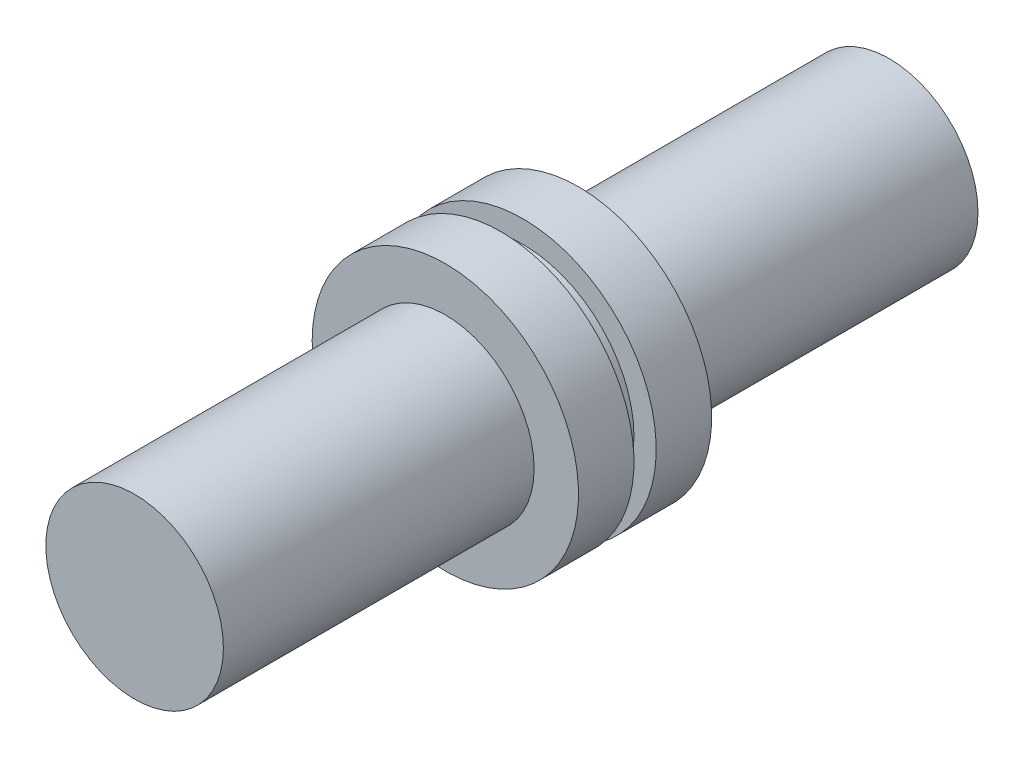
ISO-10303-21;
HEADER;
FILE_DESCRIPTION(('STEP AP214'),'2;1');
FILE_NAME('part.step','',(''),(''),'','','');
FILE_SCHEMA(('AUTOMOTIVE_DESIGN { 1 0 10303 214 1 1 1 1 }'));
ENDSEC;
DATA;
#1=APPLICATION_CONTEXT('core data for automotive mechanical design processes');
#2=APPLICATION_PROTOCOL_DEFINITION('international standard','automotive_design',2000,#1);
#3=PRODUCT_CONTEXT('',#1,'mechanical');
#4=PRODUCT('Part','Part','',(#3));
#5=PRODUCT_RELATED_PRODUCT_CATEGORY('part','',(#4));
#6=PRODUCT_DEFINITION_FORMATION('','',#4);
#7=PRODUCT_DEFINITION_CONTEXT('part definition',#1,'design');
#8=PRODUCT_DEFINITION('design','',#6,#7);
#9=PRODUCT_DEFINITION_SHAPE('','',#8);
#10=(LENGTH_UNIT() NAMED_UNIT(*) SI_UNIT(.MILLI.,.METRE.));
#11=(NAMED_UNIT(*) PLANE_ANGLE_UNIT() SI_UNIT($,.RADIAN.));
#12=(NAMED_UNIT(*) SI_UNIT($,.STERADIAN.) SOLID_ANGLE_UNIT());
#13=UNCERTAINTY_MEASURE_WITH_UNIT(LENGTH_MEASURE(1.E-05),#10,'distance_accuracy_value','');
#14=(GEOMETRIC_REPRESENTATION_CONTEXT(3) GLOBAL_UNCERTAINTY_ASSIGNED_CONTEXT((#13)) GLOBAL_UNIT_ASSIGNED_CONTEXT((#10,
#11,#12)) REPRESENTATION_CONTEXT('',''));
#15=CARTESIAN_POINT('',(0.,0.,0.));
#16=DIRECTION('',(0.,0.,1.));
#17=DIRECTION('',(1.,0.,0.));
#18=AXIS2_PLACEMENT_3D('',#15,#16,#17);
#19=CARTESIAN_POINT('',(0.,0.,7.));
#20=DIRECTION('',(0.,0.,1.));
#21=DIRECTION('',(1.,0.,0.));
#22=AXIS2_PLACEMENT_3D('',#19,#20,#21);
#23=CYLINDRICAL_SURFACE('',#22,3.);
#24=CARTESIAN_POINT('',(0.,0.,10.));
#25=DIRECTION('',(0.,0.,-1.));
#26=DIRECTION('',(-1.,0.,0.));
#27=AXIS2_PLACEMENT_3D('',#24,#25,#26);
#28=CIRCLE('',#27,3.);
#29=CARTESIAN_POINT('',(-3.,0.,10.));
#30=VERTEX_POINT('',#29);
#31=EDGE_CURVE('E70',#30,#30,#28,.T.);
#32=ORIENTED_EDGE('',*,*,#31,.T.);
#33=EDGE_LOOP('',(#32));
#34=FACE_BOUND('',#33,.T.);
#35=CARTESIAN_POINT('',(0.,0.,8.75));
#36=DIRECTION('',(0.,0.,-1.));
#37=DIRECTION('',(-1.,0.,0.));
#38=AXIS2_PLACEMENT_3D('',#35,#36,#37);
#39=CIRCLE('',#38,3.);
#40=CARTESIAN_POINT('',(-3.,0.,8.75));
#41=VERTEX_POINT('',#40);
#42=EDGE_CURVE('E39',#41,#41,#39,.T.);
#43=ORIENTED_EDGE('',*,*,#42,.F.);
#44=EDGE_LOOP('',(#43));
#45=FACE_BOUND('',#44,.T.);
#46=ADVANCED_FACE('F35',(#34,#45),#23,.T.);
#47=CARTESIAN_POINT('',(0.,0.,10.));
#48=DIRECTION('',(0.,0.,1.));
#49=DIRECTION('',(1.,0.,0.));
#50=AXIS2_PLACEMENT_3D('',#47,#48,#49);
#51=PLANE('',#50);
#52=CARTESIAN_POINT('',(0.,0.,10.));
#53=DIRECTION('',(0.,0.,1.));
#54=DIRECTION('',(1.,0.,0.));
#55=AXIS2_PLACEMENT_3D('',#52,#53,#54);
#56=CIRCLE('',#55,2.);
#57=CARTESIAN_POINT('',(2.,0.,10.));
#58=VERTEX_POINT('',#57);
#59=EDGE_CURVE('E51',#58,#58,#56,.T.);
#60=ORIENTED_EDGE('',*,*,#59,.F.);
#61=EDGE_LOOP('',(#60));
#62=FACE_BOUND('',#61,.T.);
#63=ORIENTED_EDGE('',*,*,#31,.F.);
#64=EDGE_LOOP('',(#63));
#65=FACE_BOUND('',#64,.T.);
#66=ADVANCED_FACE('F80',(#62,#65),#51,.T.);
#67=CARTESIAN_POINT('',(0.,0.,17.));
#68=DIRECTION('',(0.,0.,1.));
#69=DIRECTION('',(1.,0.,0.));
#70=AXIS2_PLACEMENT_3D('',#67,#68,#69);
#71=PLANE('',#70);
#72=CARTESIAN_POINT('',(0.,0.,17.));
#73=DIRECTION('',(0.,0.,1.));
#74=DIRECTION('',(1.,0.,0.));
#75=AXIS2_PLACEMENT_3D('',#72,#73,#74);
#76=CIRCLE('',#75,2.);
#77=CARTESIAN_POINT('',(2.,0.,17.));
#78=VERTEX_POINT('',#77);
#79=EDGE_CURVE('E43',#78,#78,#76,.T.);
#80=ORIENTED_EDGE('',*,*,#79,.T.);
#81=EDGE_LOOP('',(#80));
#82=FACE_BOUND('',#81,.T.);
#83=ADVANCED_FACE('F83',(#82),#71,.T.);
#84=CARTESIAN_POINT('',(0.,0.,17.));
#85=DIRECTION('',(0.,0.,-1.));
#86=DIRECTION('',(-1.,0.,0.));
#87=AXIS2_PLACEMENT_3D('',#84,#85,#86);
#88=CYLINDRICAL_SURFACE('',#87,2.);
#89=ORIENTED_EDGE('',*,*,#59,.T.);
#90=EDGE_LOOP('',(#89));
#91=FACE_BOUND('',#90,.T.);
#92=ORIENTED_EDGE('',*,*,#79,.F.);
#93=EDGE_LOOP('',(#92));
#94=FACE_BOUND('',#93,.T.);
#95=ADVANCED_FACE('F37',(#91,#94),#88,.T.);
#96=CARTESIAN_POINT('',(0.,0.,8.75));
#97=DIRECTION('',(0.,0.,-1.));
#98=DIRECTION('',(-1.,0.,0.));
#99=AXIS2_PLACEMENT_3D('',#96,#97,#98);
#100=PLANE('',#99);
#101=CARTESIAN_POINT('',(0.,0.,8.75));
#102=DIRECTION('',(0.,0.,1.));
#103=DIRECTION('',(1.,0.,0.));
#104=AXIS2_PLACEMENT_3D('',#101,#102,#103);
#105=CIRCLE('',#104,2.5);
#106=CARTESIAN_POINT('',(2.5,0.,8.75));
#107=VERTEX_POINT('',#106);
#108=EDGE_CURVE('E61',#107,#107,#105,.T.);
#109=ORIENTED_EDGE('',*,*,#108,.T.);
#110=EDGE_LOOP('',(#109));
#111=FACE_BOUND('',#110,.T.);
#112=ORIENTED_EDGE('',*,*,#42,.T.);
#113=EDGE_LOOP('',(#112));
#114=FACE_BOUND('',#113,.T.);
#115=ADVANCED_FACE('F93',(#111,#114),#100,.T.);
#116=CARTESIAN_POINT('',(0.,0.,8.25));
#117=DIRECTION('',(0.,0.,-1.));
#118=DIRECTION('',(-1.,0.,0.));
#119=AXIS2_PLACEMENT_3D('',#116,#117,#118);
#120=PLANE('',#119);
#121=CARTESIAN_POINT('',(0.,0.,8.25));
#122=DIRECTION('',(0.,0.,1.));
#123=DIRECTION('',(1.,0.,0.));
#124=AXIS2_PLACEMENT_3D('',#121,#122,#123);
#125=CIRCLE('',#124,2.5);
#126=CARTESIAN_POINT('',(2.5,0.,8.25));
#127=VERTEX_POINT('',#126);
#128=EDGE_CURVE('E55',#127,#127,#125,.T.);
#129=ORIENTED_EDGE('',*,*,#128,.F.);
#130=EDGE_LOOP('',(#129));
#131=FACE_BOUND('',#130,.T.);
#132=CARTESIAN_POINT('',(0.,0.,8.25));
#133=DIRECTION('',(0.,0.,-1.));
#134=DIRECTION('',(-1.,0.,0.));
#135=AXIS2_PLACEMENT_3D('',#132,#133,#134);
#136=CIRCLE('',#135,3.);
#137=CARTESIAN_POINT('',(-3.,0.,8.25));
#138=VERTEX_POINT('',#137);
#139=EDGE_CURVE('E53',#138,#138,#136,.T.);
#140=ORIENTED_EDGE('',*,*,#139,.F.);
#141=EDGE_LOOP('',(#140));
#142=FACE_BOUND('',#141,.T.);
#143=ADVANCED_FACE('F95',(#131,#142),#120,.F.);
#144=CARTESIAN_POINT('',(0.,0.,8.75));
#145=DIRECTION('',(0.,0.,-1.));
#146=DIRECTION('',(-1.,0.,0.));
#147=AXIS2_PLACEMENT_3D('',#144,#145,#146);
#148=CYLINDRICAL_SURFACE('',#147,2.5);
#149=ORIENTED_EDGE('',*,*,#108,.F.);
#150=EDGE_LOOP('',(#149));
#151=FACE_BOUND('',#150,.T.);
#152=ORIENTED_EDGE('',*,*,#128,.T.);
#153=EDGE_LOOP('',(#152));
#154=FACE_BOUND('',#153,.T.);
#155=ADVANCED_FACE('F102',(#151,#154),#148,.T.);
#156=CARTESIAN_POINT('',(0.,0.,0.));
#157=DIRECTION('',(0.,0.,1.));
#158=DIRECTION('',(1.,0.,0.));
#159=AXIS2_PLACEMENT_3D('',#156,#157,#158);
#160=PLANE('',#159);
#161=CARTESIAN_POINT('',(0.,0.,0.));
#162=DIRECTION('',(0.,0.,1.));
#163=DIRECTION('',(1.,0.,0.));
#164=AXIS2_PLACEMENT_3D('',#161,#162,#163);
#165=CIRCLE('',#164,2.);
#166=CARTESIAN_POINT('',(2.,0.,0.));
#167=VERTEX_POINT('',#166);
#168=EDGE_CURVE('E48',#167,#167,#165,.T.);
#169=ORIENTED_EDGE('',*,*,#168,.F.);
#170=EDGE_LOOP('',(#169));
#171=FACE_BOUND('',#170,.T.);
#172=ADVANCED_FACE('F114',(#171),#160,.F.);
#173=ORIENTED_EDGE('',*,*,#168,.T.);
#174=EDGE_LOOP('',(#173));
#175=FACE_BOUND('',#174,.T.);
#176=CARTESIAN_POINT('',(0.,0.,7.));
#177=DIRECTION('',(0.,0.,1.));
#178=DIRECTION('',(1.,0.,0.));
#179=AXIS2_PLACEMENT_3D('',#176,#177,#178);
#180=CIRCLE('',#179,2.);
#181=CARTESIAN_POINT('',(2.,0.,7.));
#182=VERTEX_POINT('',#181);
#183=EDGE_CURVE('E11',#182,#182,#180,.T.);
#184=ORIENTED_EDGE('',*,*,#183,.F.);
#185=EDGE_LOOP('',(#184));
#186=FACE_BOUND('',#185,.T.);
#187=ADVANCED_FACE('F105',(#175,#186),#88,.T.);
#188=CARTESIAN_POINT('',(0.,0.,7.));
#189=DIRECTION('',(0.,0.,1.));
#190=DIRECTION('',(1.,0.,0.));
#191=AXIS2_PLACEMENT_3D('',#188,#189,#190);
#192=PLANE('',#191);
#193=ORIENTED_EDGE('',*,*,#183,.T.);
#194=EDGE_LOOP('',(#193));
#195=FACE_BOUND('',#194,.T.);
#196=CARTESIAN_POINT('',(0.,0.,7.));
#197=DIRECTION('',(0.,0.,-1.));
#198=DIRECTION('',(-1.,0.,0.));
#199=AXIS2_PLACEMENT_3D('',#196,#197,#198);
#200=CIRCLE('',#199,3.);
#201=CARTESIAN_POINT('',(-3.,0.,7.));
#202=VERTEX_POINT('',#201);
#203=EDGE_CURVE('E59',#202,#202,#200,.T.);
#204=ORIENTED_EDGE('',*,*,#203,.T.);
#205=EDGE_LOOP('',(#204));
#206=FACE_BOUND('',#205,.T.);
#207=ADVANCED_FACE('F108',(#195,#206),#192,.F.);
#208=ORIENTED_EDGE('',*,*,#139,.T.);
#209=EDGE_LOOP('',(#208));
#210=FACE_BOUND('',#209,.T.);
#211=ORIENTED_EDGE('',*,*,#203,.F.);
#212=EDGE_LOOP('',(#211));
#213=FACE_BOUND('',#212,.T.);
#214=ADVANCED_FACE('F90',(#210,#213),#23,.T.);
#215=CLOSED_SHELL('',(#46,#66,#83,#95,#115,#143,#155,#172,#187,#207,#214));
#216=MANIFOLD_SOLID_BREP('B2',#215);
#217=ADVANCED_BREP_SHAPE_REPRESENTATION('',(#18,#216),#14);
#218=SHAPE_DEFINITION_REPRESENTATION(#9,#217);
ENDSEC;
END-ISO-10303-21;
